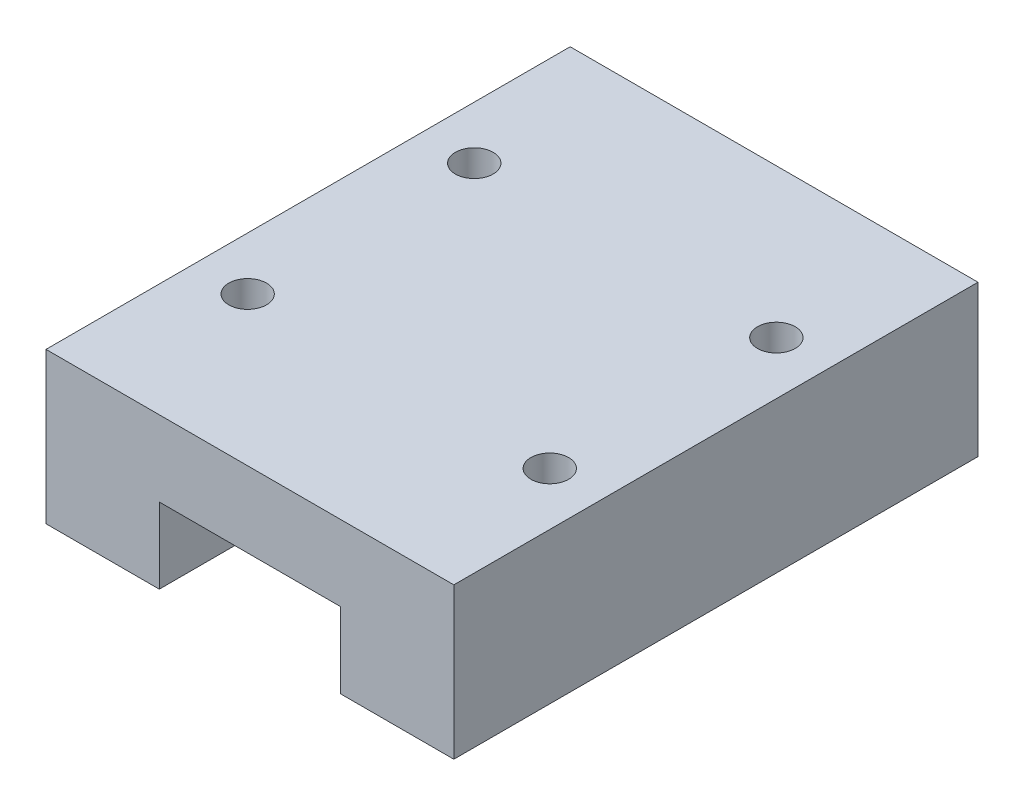
ISO-10303-21;
HEADER;
FILE_DESCRIPTION(('STEP AP214'),'2;1');
FILE_NAME('part.step','',(''),(''),'','','');
FILE_SCHEMA(('AUTOMOTIVE_DESIGN { 1 0 10303 214 1 1 1 1 }'));
ENDSEC;
DATA;
#1=APPLICATION_CONTEXT('core data for automotive mechanical design processes');
#2=APPLICATION_PROTOCOL_DEFINITION('international standard','automotive_design',2000,#1);
#3=PRODUCT_CONTEXT('',#1,'mechanical');
#4=PRODUCT('Part','Part','',(#3));
#5=PRODUCT_RELATED_PRODUCT_CATEGORY('part','',(#4));
#6=PRODUCT_DEFINITION_FORMATION('','',#4);
#7=PRODUCT_DEFINITION_CONTEXT('part definition',#1,'design');
#8=PRODUCT_DEFINITION('design','',#6,#7);
#9=PRODUCT_DEFINITION_SHAPE('','',#8);
#10=(LENGTH_UNIT() NAMED_UNIT(*) SI_UNIT(.MILLI.,.METRE.));
#11=(NAMED_UNIT(*) PLANE_ANGLE_UNIT() SI_UNIT($,.RADIAN.));
#12=(NAMED_UNIT(*) SI_UNIT($,.STERADIAN.) SOLID_ANGLE_UNIT());
#13=UNCERTAINTY_MEASURE_WITH_UNIT(LENGTH_MEASURE(1.E-05),#10,'distance_accuracy_value','');
#14=(GEOMETRIC_REPRESENTATION_CONTEXT(3) GLOBAL_UNCERTAINTY_ASSIGNED_CONTEXT((#13)) GLOBAL_UNIT_ASSIGNED_CONTEXT((#10,
#11,#12)) REPRESENTATION_CONTEXT('',''));
#15=CARTESIAN_POINT('',(0.,0.,0.));
#16=DIRECTION('',(0.,0.,1.));
#17=DIRECTION('',(1.,0.,0.));
#18=AXIS2_PLACEMENT_3D('',#15,#16,#17);
#19=CARTESIAN_POINT('',(0.,0.,34.7));
#20=DIRECTION('',(0.,1.,0.));
#21=DIRECTION('',(0.,0.,1.));
#22=AXIS2_PLACEMENT_3D('',#19,#20,#21);
#23=PLANE('',#22);
#24=CARTESIAN_POINT('',(23.5,0.,24.85));
#25=DIRECTION('',(0.,1.,0.));
#26=DIRECTION('',(0.,0.,1.));
#27=AXIS2_PLACEMENT_3D('',#24,#25,#26);
#28=CIRCLE('',#27,1.25);
#29=CARTESIAN_POINT('',(23.5,0.,26.1));
#30=VERTEX_POINT('',#29);
#31=EDGE_CURVE('E292',#30,#30,#28,.T.);
#32=ORIENTED_EDGE('',*,*,#31,.T.);
#33=EDGE_LOOP('',(#32));
#34=FACE_BOUND('',#33,.T.);
#35=CARTESIAN_POINT('',(23.5,0.,9.85));
#36=DIRECTION('',(0.,1.,0.));
#37=DIRECTION('',(0.,0.,1.));
#38=AXIS2_PLACEMENT_3D('',#35,#36,#37);
#39=CIRCLE('',#38,1.25);
#40=CARTESIAN_POINT('',(23.5,0.,11.1));
#41=VERTEX_POINT('',#40);
#42=EDGE_CURVE('E301',#41,#41,#39,.T.);
#43=ORIENTED_EDGE('',*,*,#42,.T.);
#44=EDGE_LOOP('',(#43));
#45=FACE_BOUND('',#44,.T.);
#46=DIRECTION('',(1.,0.,0.));
#47=VECTOR('',#46,1.);
#48=CARTESIAN_POINT('',(0.,0.,34.7));
#49=LINE('',#48,#47);
#50=CARTESIAN_POINT('',(19.5,0.,34.7));
#51=VERTEX_POINT('',#50);
#52=CARTESIAN_POINT('',(27.,0.,34.7));
#53=VERTEX_POINT('',#52);
#54=EDGE_CURVE('E125',#51,#53,#49,.T.);
#55=ORIENTED_EDGE('',*,*,#54,.F.);
#56=DIRECTION('',(0.,0.,-1.));
#57=VECTOR('',#56,1.);
#58=CARTESIAN_POINT('',(19.5,0.,34.7));
#59=LINE('',#58,#57);
#60=CARTESIAN_POINT('',(19.5,0.,0.));
#61=VERTEX_POINT('',#60);
#62=EDGE_CURVE('E112',#51,#61,#59,.T.);
#63=ORIENTED_EDGE('',*,*,#62,.T.);
#64=DIRECTION('',(1.,0.,0.));
#65=VECTOR('',#64,1.);
#66=CARTESIAN_POINT('',(0.,0.,0.));
#67=LINE('',#66,#65);
#68=CARTESIAN_POINT('',(27.,0.,0.));
#69=VERTEX_POINT('',#68);
#70=EDGE_CURVE('E145',#61,#69,#67,.T.);
#71=ORIENTED_EDGE('',*,*,#70,.T.);
#72=DIRECTION('',(0.,0.,-1.));
#73=VECTOR('',#72,1.);
#74=CARTESIAN_POINT('',(27.,0.,34.7));
#75=LINE('',#74,#73);
#76=EDGE_CURVE('E45',#53,#69,#75,.T.);
#77=ORIENTED_EDGE('',*,*,#76,.F.);
#78=EDGE_LOOP('',(#55,#63,#71,#77));
#79=FACE_BOUND('',#78,.T.);
#80=ADVANCED_FACE('F37',(#34,#45,#79),#23,.F.);
#81=CARTESIAN_POINT('',(0.,0.,34.7));
#82=DIRECTION('',(1.,0.,0.));
#83=DIRECTION('',(0.,0.,-1.));
#84=AXIS2_PLACEMENT_3D('',#81,#82,#83);
#85=PLANE('',#84);
#86=DIRECTION('',(0.,-1.,0.));
#87=VECTOR('',#86,1.);
#88=CARTESIAN_POINT('',(0.,0.,0.));
#89=LINE('',#88,#87);
#90=CARTESIAN_POINT('',(0.,10.,0.));
#91=VERTEX_POINT('',#90);
#92=CARTESIAN_POINT('',(0.,0.,0.));
#93=VERTEX_POINT('',#92);
#94=EDGE_CURVE('E142',#91,#93,#89,.T.);
#95=ORIENTED_EDGE('',*,*,#94,.T.);
#96=DIRECTION('',(0.,0.,-1.));
#97=VECTOR('',#96,1.);
#98=CARTESIAN_POINT('',(0.,0.,34.7));
#99=LINE('',#98,#97);
#100=CARTESIAN_POINT('',(0.,0.,34.7));
#101=VERTEX_POINT('',#100);
#102=EDGE_CURVE('E11',#101,#93,#99,.T.);
#103=ORIENTED_EDGE('',*,*,#102,.F.);
#104=DIRECTION('',(0.,-1.,0.));
#105=VECTOR('',#104,1.);
#106=CARTESIAN_POINT('',(0.,0.,34.7));
#107=LINE('',#106,#105);
#108=CARTESIAN_POINT('',(0.,10.,34.7));
#109=VERTEX_POINT('',#108);
#110=EDGE_CURVE('E134',#109,#101,#107,.T.);
#111=ORIENTED_EDGE('',*,*,#110,.F.);
#112=DIRECTION('',(0.,0.,-1.));
#113=VECTOR('',#112,1.);
#114=CARTESIAN_POINT('',(0.,10.,34.7));
#115=LINE('',#114,#113);
#116=EDGE_CURVE('E141',#109,#91,#115,.T.);
#117=ORIENTED_EDGE('',*,*,#116,.T.);
#118=EDGE_LOOP('',(#95,#103,#111,#117));
#119=FACE_BOUND('',#118,.T.);
#120=ADVANCED_FACE('F39',(#119),#85,.F.);
#121=CARTESIAN_POINT('',(3.5,0.,24.85));
#122=DIRECTION('',(0.,1.,0.));
#123=DIRECTION('',(0.,0.,1.));
#124=AXIS2_PLACEMENT_3D('',#121,#122,#123);
#125=CIRCLE('',#124,1.25);
#126=CARTESIAN_POINT('',(3.5,0.,26.1));
#127=VERTEX_POINT('',#126);
#128=EDGE_CURVE('E195',#127,#127,#125,.T.);
#129=ORIENTED_EDGE('',*,*,#128,.T.);
#130=EDGE_LOOP('',(#129));
#131=FACE_BOUND('',#130,.T.);
#132=CARTESIAN_POINT('',(3.5,0.,9.85));
#133=DIRECTION('',(0.,1.,0.));
#134=DIRECTION('',(0.,0.,1.));
#135=AXIS2_PLACEMENT_3D('',#132,#133,#134);
#136=CIRCLE('',#135,1.25);
#137=CARTESIAN_POINT('',(3.5,0.,11.1));
#138=VERTEX_POINT('',#137);
#139=EDGE_CURVE('E198',#138,#138,#136,.T.);
#140=ORIENTED_EDGE('',*,*,#139,.T.);
#141=EDGE_LOOP('',(#140));
#142=FACE_BOUND('',#141,.T.);
#143=CARTESIAN_POINT('',(7.5,0.,0.));
#144=VERTEX_POINT('',#143);
#145=EDGE_CURVE('E147',#93,#144,#67,.T.);
#146=ORIENTED_EDGE('',*,*,#145,.T.);
#147=DIRECTION('',(0.,0.,-1.));
#148=VECTOR('',#147,1.);
#149=CARTESIAN_POINT('',(7.5,0.,34.7));
#150=LINE('',#149,#148);
#151=CARTESIAN_POINT('',(7.5,0.,34.7));
#152=VERTEX_POINT('',#151);
#153=EDGE_CURVE('E52',#152,#144,#150,.T.);
#154=ORIENTED_EDGE('',*,*,#153,.F.);
#155=EDGE_CURVE('E88',#101,#152,#49,.T.);
#156=ORIENTED_EDGE('',*,*,#155,.F.);
#157=ORIENTED_EDGE('',*,*,#102,.T.);
#158=EDGE_LOOP('',(#146,#154,#156,#157));
#159=FACE_BOUND('',#158,.T.);
#160=ADVANCED_FACE('F176',(#131,#142,#159),#23,.F.);
#161=CARTESIAN_POINT('',(27.,0.,34.7));
#162=DIRECTION('',(-1.,0.,0.));
#163=DIRECTION('',(0.,0.,1.));
#164=AXIS2_PLACEMENT_3D('',#161,#162,#163);
#165=PLANE('',#164);
#166=DIRECTION('',(0.,1.,0.));
#167=VECTOR('',#166,1.);
#168=CARTESIAN_POINT('',(27.,0.,0.));
#169=LINE('',#168,#167);
#170=CARTESIAN_POINT('',(27.,10.,0.));
#171=VERTEX_POINT('',#170);
#172=EDGE_CURVE('E150',#69,#171,#169,.T.);
#173=ORIENTED_EDGE('',*,*,#172,.T.);
#174=DIRECTION('',(0.,0.,-1.));
#175=VECTOR('',#174,1.);
#176=CARTESIAN_POINT('',(27.,10.,34.7));
#177=LINE('',#176,#175);
#178=CARTESIAN_POINT('',(27.,10.,34.7));
#179=VERTEX_POINT('',#178);
#180=EDGE_CURVE('E154',#179,#171,#177,.T.);
#181=ORIENTED_EDGE('',*,*,#180,.F.);
#182=DIRECTION('',(0.,1.,0.));
#183=VECTOR('',#182,1.);
#184=CARTESIAN_POINT('',(27.,0.,34.7));
#185=LINE('',#184,#183);
#186=EDGE_CURVE('E136',#53,#179,#185,.T.);
#187=ORIENTED_EDGE('',*,*,#186,.F.);
#188=ORIENTED_EDGE('',*,*,#76,.T.);
#189=EDGE_LOOP('',(#173,#181,#187,#188));
#190=FACE_BOUND('',#189,.T.);
#191=ADVANCED_FACE('F157',(#190),#165,.F.);
#192=CARTESIAN_POINT('',(0.,10.,34.7));
#193=DIRECTION('',(0.,-1.,0.));
#194=DIRECTION('',(0.,0.,-1.));
#195=AXIS2_PLACEMENT_3D('',#192,#193,#194);
#196=PLANE('',#195);
#197=CARTESIAN_POINT('',(23.5,10.,24.85));
#198=DIRECTION('',(0.,1.,0.));
#199=DIRECTION('',(0.,0.,1.));
#200=AXIS2_PLACEMENT_3D('',#197,#198,#199);
#201=CIRCLE('',#200,1.25);
#202=CARTESIAN_POINT('',(23.5,10.,26.1));
#203=VERTEX_POINT('',#202);
#204=EDGE_CURVE('E294',#203,#203,#201,.T.);
#205=ORIENTED_EDGE('',*,*,#204,.F.);
#206=EDGE_LOOP('',(#205));
#207=FACE_BOUND('',#206,.T.);
#208=CARTESIAN_POINT('',(23.5,10.,9.85));
#209=DIRECTION('',(0.,1.,0.));
#210=DIRECTION('',(0.,0.,1.));
#211=AXIS2_PLACEMENT_3D('',#208,#209,#210);
#212=CIRCLE('',#211,1.25);
#213=CARTESIAN_POINT('',(23.5,10.,11.1));
#214=VERTEX_POINT('',#213);
#215=EDGE_CURVE('E296',#214,#214,#212,.T.);
#216=ORIENTED_EDGE('',*,*,#215,.F.);
#217=EDGE_LOOP('',(#216));
#218=FACE_BOUND('',#217,.T.);
#219=CARTESIAN_POINT('',(3.5,10.,24.85));
#220=DIRECTION('',(0.,1.,0.));
#221=DIRECTION('',(0.,0.,1.));
#222=AXIS2_PLACEMENT_3D('',#219,#220,#221);
#223=CIRCLE('',#222,1.25);
#224=CARTESIAN_POINT('',(3.5,10.,26.1));
#225=VERTEX_POINT('',#224);
#226=EDGE_CURVE('E304',#225,#225,#223,.T.);
#227=ORIENTED_EDGE('',*,*,#226,.F.);
#228=EDGE_LOOP('',(#227));
#229=FACE_BOUND('',#228,.T.);
#230=CARTESIAN_POINT('',(3.5,10.,9.85));
#231=DIRECTION('',(0.,1.,0.));
#232=DIRECTION('',(0.,0.,1.));
#233=AXIS2_PLACEMENT_3D('',#230,#231,#232);
#234=CIRCLE('',#233,1.25);
#235=CARTESIAN_POINT('',(3.5,10.,11.1));
#236=VERTEX_POINT('',#235);
#237=EDGE_CURVE('E308',#236,#236,#234,.T.);
#238=ORIENTED_EDGE('',*,*,#237,.F.);
#239=EDGE_LOOP('',(#238));
#240=FACE_BOUND('',#239,.T.);
#241=DIRECTION('',(-1.,0.,0.));
#242=VECTOR('',#241,1.);
#243=CARTESIAN_POINT('',(0.,10.,0.));
#244=LINE('',#243,#242);
#245=EDGE_CURVE('E82',#171,#91,#244,.T.);
#246=ORIENTED_EDGE('',*,*,#245,.T.);
#247=ORIENTED_EDGE('',*,*,#116,.F.);
#248=DIRECTION('',(-1.,0.,0.));
#249=VECTOR('',#248,1.);
#250=CARTESIAN_POINT('',(0.,10.,34.7));
#251=LINE('',#250,#249);
#252=EDGE_CURVE('E61',#179,#109,#251,.T.);
#253=ORIENTED_EDGE('',*,*,#252,.F.);
#254=ORIENTED_EDGE('',*,*,#180,.T.);
#255=EDGE_LOOP('',(#246,#247,#253,#254));
#256=FACE_BOUND('',#255,.T.);
#257=ADVANCED_FACE('F165',(#207,#218,#229,#240,#256),#196,.F.);
#258=CARTESIAN_POINT('',(0.,0.,34.7));
#259=DIRECTION('',(0.,0.,-1.));
#260=DIRECTION('',(-1.,0.,0.));
#261=AXIS2_PLACEMENT_3D('',#258,#259,#260);
#262=PLANE('',#261);
#263=DIRECTION('',(1.,0.,0.));
#264=VECTOR('',#263,1.);
#265=CARTESIAN_POINT('',(19.5,5.,34.7));
#266=LINE('',#265,#264);
#267=CARTESIAN_POINT('',(7.5,5.,34.7));
#268=VERTEX_POINT('',#267);
#269=CARTESIAN_POINT('',(19.5,5.,34.7));
#270=VERTEX_POINT('',#269);
#271=EDGE_CURVE('E122',#268,#270,#266,.T.);
#272=ORIENTED_EDGE('',*,*,#271,.T.);
#273=DIRECTION('',(0.,-1.,0.));
#274=VECTOR('',#273,1.);
#275=CARTESIAN_POINT('',(19.5,0.,34.7));
#276=LINE('',#275,#274);
#277=EDGE_CURVE('E115',#270,#51,#276,.T.);
#278=ORIENTED_EDGE('',*,*,#277,.T.);
#279=ORIENTED_EDGE('',*,*,#54,.T.);
#280=ORIENTED_EDGE('',*,*,#186,.T.);
#281=ORIENTED_EDGE('',*,*,#252,.T.);
#282=ORIENTED_EDGE('',*,*,#110,.T.);
#283=ORIENTED_EDGE('',*,*,#155,.T.);
#284=DIRECTION('',(0.,1.,0.));
#285=VECTOR('',#284,1.);
#286=CARTESIAN_POINT('',(7.5,0.,34.7));
#287=LINE('',#286,#285);
#288=EDGE_CURVE('E129',#152,#268,#287,.T.);
#289=ORIENTED_EDGE('',*,*,#288,.T.);
#290=EDGE_LOOP('',(#272,#278,#279,#280,#281,#282,#283,#289));
#291=FACE_BOUND('',#290,.T.);
#292=ADVANCED_FACE('F124',(#291),#262,.F.);
#293=CARTESIAN_POINT('',(0.,0.,0.));
#294=DIRECTION('',(0.,0.,-1.));
#295=DIRECTION('',(-1.,0.,0.));
#296=AXIS2_PLACEMENT_3D('',#293,#294,#295);
#297=PLANE('',#296);
#298=DIRECTION('',(0.,-1.,0.));
#299=VECTOR('',#298,1.);
#300=CARTESIAN_POINT('',(19.5,0.,0.));
#301=LINE('',#300,#299);
#302=CARTESIAN_POINT('',(19.5,5.,0.));
#303=VERTEX_POINT('',#302);
#304=EDGE_CURVE('E118',#303,#61,#301,.T.);
#305=ORIENTED_EDGE('',*,*,#304,.F.);
#306=DIRECTION('',(1.,0.,0.));
#307=VECTOR('',#306,1.);
#308=CARTESIAN_POINT('',(19.5,5.,0.));
#309=LINE('',#308,#307);
#310=CARTESIAN_POINT('',(7.5,5.,0.));
#311=VERTEX_POINT('',#310);
#312=EDGE_CURVE('E130',#311,#303,#309,.T.);
#313=ORIENTED_EDGE('',*,*,#312,.F.);
#314=DIRECTION('',(0.,1.,0.));
#315=VECTOR('',#314,1.);
#316=CARTESIAN_POINT('',(7.5,0.,0.));
#317=LINE('',#316,#315);
#318=EDGE_CURVE('E206',#144,#311,#317,.T.);
#319=ORIENTED_EDGE('',*,*,#318,.F.);
#320=ORIENTED_EDGE('',*,*,#145,.F.);
#321=ORIENTED_EDGE('',*,*,#94,.F.);
#322=ORIENTED_EDGE('',*,*,#245,.F.);
#323=ORIENTED_EDGE('',*,*,#172,.F.);
#324=ORIENTED_EDGE('',*,*,#70,.F.);
#325=EDGE_LOOP('',(#305,#313,#319,#320,#321,#322,#323,#324));
#326=FACE_BOUND('',#325,.T.);
#327=ADVANCED_FACE('F160',(#326),#297,.T.);
#328=CARTESIAN_POINT('',(19.5,0.,34.7));
#329=DIRECTION('',(1.,0.,0.));
#330=DIRECTION('',(0.,0.,-1.));
#331=AXIS2_PLACEMENT_3D('',#328,#329,#330);
#332=PLANE('',#331);
#333=ORIENTED_EDGE('',*,*,#304,.T.);
#334=ORIENTED_EDGE('',*,*,#62,.F.);
#335=ORIENTED_EDGE('',*,*,#277,.F.);
#336=DIRECTION('',(0.,0.,-1.));
#337=VECTOR('',#336,1.);
#338=CARTESIAN_POINT('',(19.5,5.,34.7));
#339=LINE('',#338,#337);
#340=EDGE_CURVE('E146',#270,#303,#339,.T.);
#341=ORIENTED_EDGE('',*,*,#340,.T.);
#342=EDGE_LOOP('',(#333,#334,#335,#341));
#343=FACE_BOUND('',#342,.T.);
#344=ADVANCED_FACE('F114',(#343),#332,.F.);
#345=CARTESIAN_POINT('',(19.5,5.,34.7));
#346=DIRECTION('',(0.,1.,0.));
#347=DIRECTION('',(0.,0.,1.));
#348=AXIS2_PLACEMENT_3D('',#345,#346,#347);
#349=PLANE('',#348);
#350=ORIENTED_EDGE('',*,*,#312,.T.);
#351=ORIENTED_EDGE('',*,*,#340,.F.);
#352=ORIENTED_EDGE('',*,*,#271,.F.);
#353=DIRECTION('',(0.,0.,-1.));
#354=VECTOR('',#353,1.);
#355=CARTESIAN_POINT('',(7.5,5.,34.7));
#356=LINE('',#355,#354);
#357=EDGE_CURVE('E199',#268,#311,#356,.T.);
#358=ORIENTED_EDGE('',*,*,#357,.T.);
#359=EDGE_LOOP('',(#350,#351,#352,#358));
#360=FACE_BOUND('',#359,.T.);
#361=ADVANCED_FACE('F212',(#360),#349,.F.);
#362=CARTESIAN_POINT('',(7.5,0.,34.7));
#363=DIRECTION('',(-1.,0.,0.));
#364=DIRECTION('',(0.,0.,1.));
#365=AXIS2_PLACEMENT_3D('',#362,#363,#364);
#366=PLANE('',#365);
#367=ORIENTED_EDGE('',*,*,#318,.T.);
#368=ORIENTED_EDGE('',*,*,#357,.F.);
#369=ORIENTED_EDGE('',*,*,#288,.F.);
#370=ORIENTED_EDGE('',*,*,#153,.T.);
#371=EDGE_LOOP('',(#367,#368,#369,#370));
#372=FACE_BOUND('',#371,.T.);
#373=ADVANCED_FACE('F214',(#372),#366,.F.);
#374=CARTESIAN_POINT('',(3.5,10.,9.85));
#375=DIRECTION('',(0.,1.,0.));
#376=DIRECTION('',(0.,0.,1.));
#377=AXIS2_PLACEMENT_3D('',#374,#375,#376);
#378=CYLINDRICAL_SURFACE('',#377,1.25);
#379=ORIENTED_EDGE('',*,*,#139,.F.);
#380=EDGE_LOOP('',(#379));
#381=FACE_BOUND('',#380,.T.);
#382=ORIENTED_EDGE('',*,*,#237,.T.);
#383=EDGE_LOOP('',(#382));
#384=FACE_BOUND('',#383,.T.);
#385=ADVANCED_FACE('F216',(#381,#384),#378,.F.);
#386=CARTESIAN_POINT('',(3.5,10.,24.85));
#387=DIRECTION('',(0.,1.,0.));
#388=DIRECTION('',(0.,0.,1.));
#389=AXIS2_PLACEMENT_3D('',#386,#387,#388);
#390=CYLINDRICAL_SURFACE('',#389,1.25);
#391=ORIENTED_EDGE('',*,*,#128,.F.);
#392=EDGE_LOOP('',(#391));
#393=FACE_BOUND('',#392,.T.);
#394=ORIENTED_EDGE('',*,*,#226,.T.);
#395=EDGE_LOOP('',(#394));
#396=FACE_BOUND('',#395,.T.);
#397=ADVANCED_FACE('F221',(#393,#396),#390,.F.);
#398=CARTESIAN_POINT('',(23.5,10.,9.85));
#399=DIRECTION('',(0.,1.,0.));
#400=DIRECTION('',(0.,0.,1.));
#401=AXIS2_PLACEMENT_3D('',#398,#399,#400);
#402=CYLINDRICAL_SURFACE('',#401,1.25);
#403=ORIENTED_EDGE('',*,*,#42,.F.);
#404=EDGE_LOOP('',(#403));
#405=FACE_BOUND('',#404,.T.);
#406=ORIENTED_EDGE('',*,*,#215,.T.);
#407=EDGE_LOOP('',(#406));
#408=FACE_BOUND('',#407,.T.);
#409=ADVANCED_FACE('F259',(#405,#408),#402,.F.);
#410=CARTESIAN_POINT('',(23.5,10.,24.85));
#411=DIRECTION('',(0.,1.,0.));
#412=DIRECTION('',(0.,0.,1.));
#413=AXIS2_PLACEMENT_3D('',#410,#411,#412);
#414=CYLINDRICAL_SURFACE('',#413,1.25);
#415=ORIENTED_EDGE('',*,*,#31,.F.);
#416=EDGE_LOOP('',(#415));
#417=FACE_BOUND('',#416,.T.);
#418=ORIENTED_EDGE('',*,*,#204,.T.);
#419=EDGE_LOOP('',(#418));
#420=FACE_BOUND('',#419,.T.);
#421=ADVANCED_FACE('F269',(#417,#420),#414,.F.);
#422=CLOSED_SHELL('',(#80,#120,#160,#191,#257,#292,#327,#344,#361,#373,#385,#397,#409,#421));
#423=MANIFOLD_SOLID_BREP('B2',#422);
#424=ADVANCED_BREP_SHAPE_REPRESENTATION('',(#18,#423),#14);
#425=SHAPE_DEFINITION_REPRESENTATION(#9,#424);
ENDSEC;
END-ISO-10303-21;
